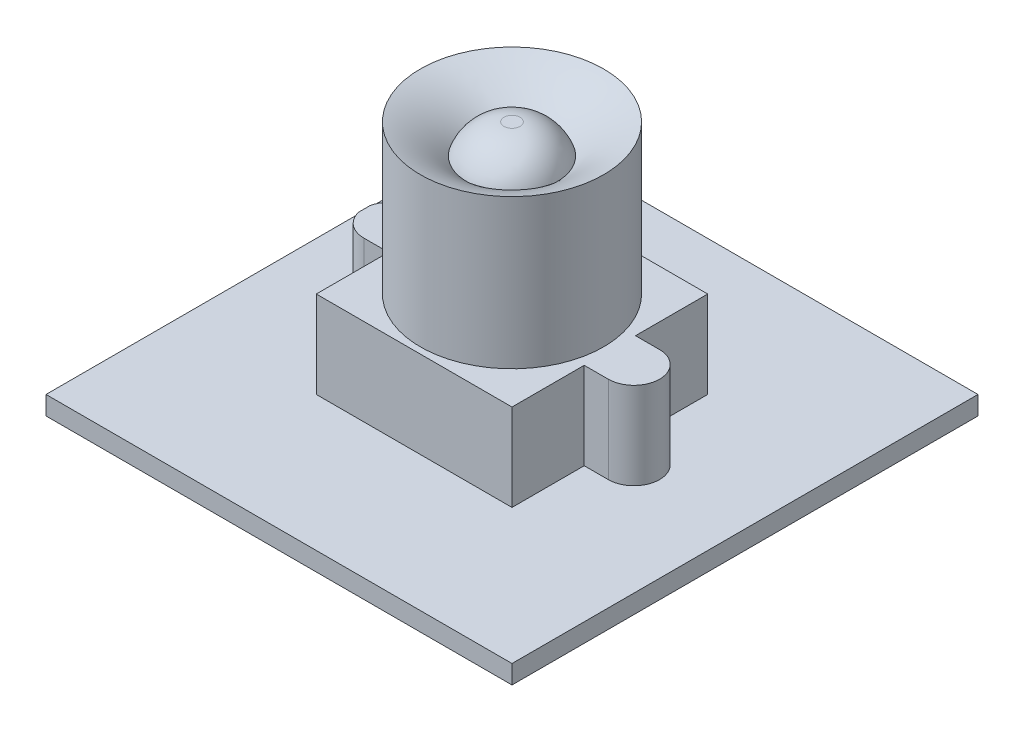
ISO-10303-21;
HEADER;
FILE_DESCRIPTION(('STEP AP214'),'2;1');
FILE_NAME('part.step','',(''),(''),'','','');
FILE_SCHEMA(('AUTOMOTIVE_DESIGN { 1 0 10303 214 1 1 1 1 }'));
ENDSEC;
DATA;
#1=APPLICATION_CONTEXT('core data for automotive mechanical design processes');
#2=APPLICATION_PROTOCOL_DEFINITION('international standard','automotive_design',2000,#1);
#3=PRODUCT_CONTEXT('',#1,'mechanical');
#4=PRODUCT('Part','Part','',(#3));
#5=PRODUCT_RELATED_PRODUCT_CATEGORY('part','',(#4));
#6=PRODUCT_DEFINITION_FORMATION('','',#4);
#7=PRODUCT_DEFINITION_CONTEXT('part definition',#1,'design');
#8=PRODUCT_DEFINITION('design','',#6,#7);
#9=PRODUCT_DEFINITION_SHAPE('','',#8);
#10=(LENGTH_UNIT() NAMED_UNIT(*) SI_UNIT(.MILLI.,.METRE.));
#11=(NAMED_UNIT(*) PLANE_ANGLE_UNIT() SI_UNIT($,.RADIAN.));
#12=(NAMED_UNIT(*) SI_UNIT($,.STERADIAN.) SOLID_ANGLE_UNIT());
#13=UNCERTAINTY_MEASURE_WITH_UNIT(LENGTH_MEASURE(1.E-05),#10,'distance_accuracy_value','');
#14=(GEOMETRIC_REPRESENTATION_CONTEXT(3) GLOBAL_UNCERTAINTY_ASSIGNED_CONTEXT((#13)) GLOBAL_UNIT_ASSIGNED_CONTEXT((#10,
#11,#12)) REPRESENTATION_CONTEXT('',''));
#15=CARTESIAN_POINT('',(0.,0.,0.));
#16=DIRECTION('',(0.,0.,1.));
#17=DIRECTION('',(1.,0.,0.));
#18=AXIS2_PLACEMENT_3D('',#15,#16,#17);
#19=CARTESIAN_POINT('',(0.,1.524,0.));
#20=DIRECTION('',(0.,1.,0.));
#21=DIRECTION('',(0.,0.,1.));
#22=AXIS2_PLACEMENT_3D('',#19,#20,#21);
#23=PLANE('',#22);
#24=DIRECTION('',(0.,0.,-1.));
#25=VECTOR('',#24,1.);
#26=CARTESIAN_POINT('',(19.05,1.524,-19.05));
#27=LINE('',#26,#25);
#28=CARTESIAN_POINT('',(19.05,1.524,19.05));
#29=VERTEX_POINT('',#28);
#30=CARTESIAN_POINT('',(19.05,1.524,-19.05));
#31=VERTEX_POINT('',#30);
#32=EDGE_CURVE('E274',#29,#31,#27,.T.);
#33=ORIENTED_EDGE('',*,*,#32,.T.);
#34=DIRECTION('',(-1.,0.,0.));
#35=VECTOR('',#34,1.);
#36=CARTESIAN_POINT('',(-19.05,1.524,-19.05));
#37=LINE('',#36,#35);
#38=CARTESIAN_POINT('',(-19.05,1.524,-19.05));
#39=VERTEX_POINT('',#38);
#40=EDGE_CURVE('E277',#31,#39,#37,.T.);
#41=ORIENTED_EDGE('',*,*,#40,.T.);
#42=DIRECTION('',(0.,0.,1.));
#43=VECTOR('',#42,1.);
#44=CARTESIAN_POINT('',(-19.05,1.524,-19.05));
#45=LINE('',#44,#43);
#46=CARTESIAN_POINT('',(-19.05,1.524,19.05));
#47=VERTEX_POINT('',#46);
#48=EDGE_CURVE('E280',#39,#47,#45,.T.);
#49=ORIENTED_EDGE('',*,*,#48,.T.);
#50=DIRECTION('',(1.,0.,0.));
#51=VECTOR('',#50,1.);
#52=CARTESIAN_POINT('',(-19.05,1.524,19.05));
#53=LINE('',#52,#51);
#54=EDGE_CURVE('E282',#47,#29,#53,.T.);
#55=ORIENTED_EDGE('',*,*,#54,.T.);
#56=EDGE_LOOP('',(#33,#41,#49,#55));
#57=FACE_BOUND('',#56,.T.);
#58=CARTESIAN_POINT('',(9.96949999999999,1.524,0.));
#59=DIRECTION('',(0.,1.,0.));
#60=DIRECTION('',(0.,0.,1.));
#61=AXIS2_PLACEMENT_3D('',#58,#59,#60);
#62=CIRCLE('',#61,2.0955);
#63=CARTESIAN_POINT('',(9.96949999999999,1.524,-2.0955));
#64=VERTEX_POINT('',#63);
#65=CARTESIAN_POINT('',(9.96949999999999,1.524,2.0955));
#66=VERTEX_POINT('',#65);
#67=EDGE_CURVE('E596',#64,#66,#62,.F.);
#68=ORIENTED_EDGE('',*,*,#67,.T.);
#69=DIRECTION('',(1.,0.,0.));
#70=VECTOR('',#69,1.);
#71=CARTESIAN_POINT('',(0.,1.524,2.0955));
#72=LINE('',#71,#70);
#73=CARTESIAN_POINT('',(8.001,1.524,2.0955));
#74=VERTEX_POINT('',#73);
#75=EDGE_CURVE('E612',#74,#66,#72,.T.);
#76=ORIENTED_EDGE('',*,*,#75,.F.);
#77=DIRECTION('',(0.,0.,-1.));
#78=VECTOR('',#77,1.);
#79=CARTESIAN_POINT('',(8.001,1.524,-8.001));
#80=LINE('',#79,#78);
#81=CARTESIAN_POINT('',(8.001,1.524,8.001));
#82=VERTEX_POINT('',#81);
#83=EDGE_CURVE('E251',#82,#74,#80,.T.);
#84=ORIENTED_EDGE('',*,*,#83,.F.);
#85=DIRECTION('',(1.,0.,0.));
#86=VECTOR('',#85,1.);
#87=CARTESIAN_POINT('',(-8.001,1.524,8.001));
#88=LINE('',#87,#86);
#89=CARTESIAN_POINT('',(-8.001,1.524,8.001));
#90=VERTEX_POINT('',#89);
#91=EDGE_CURVE('E260',#90,#82,#88,.T.);
#92=ORIENTED_EDGE('',*,*,#91,.F.);
#93=DIRECTION('',(0.,0.,1.));
#94=VECTOR('',#93,1.);
#95=CARTESIAN_POINT('',(-8.001,1.524,-8.001));
#96=LINE('',#95,#94);
#97=CARTESIAN_POINT('',(-8.001,1.524,2.0955));
#98=VERTEX_POINT('',#97);
#99=EDGE_CURVE('E256',#98,#90,#96,.T.);
#100=ORIENTED_EDGE('',*,*,#99,.F.);
#101=CARTESIAN_POINT('',(-10.0225174114188,1.524,2.0955));
#102=VERTEX_POINT('',#101);
#103=EDGE_CURVE('E585',#102,#98,#72,.T.);
#104=ORIENTED_EDGE('',*,*,#103,.F.);
#105=CARTESIAN_POINT('',(-10.0225174114188,1.524,0.));
#106=DIRECTION('',(0.,1.,0.));
#107=DIRECTION('',(0.,0.,1.));
#108=AXIS2_PLACEMENT_3D('',#105,#106,#107);
#109=CIRCLE('',#108,2.0955);
#110=CARTESIAN_POINT('',(-12.065,1.524,0.46838565877132));
#111=VERTEX_POINT('',#110);
#112=EDGE_CURVE('E613',#102,#111,#109,.F.);
#113=ORIENTED_EDGE('',*,*,#112,.T.);
#114=DIRECTION('',(0.,0.,1.));
#115=VECTOR('',#114,1.);
#116=CARTESIAN_POINT('',(-12.065,1.524,0.));
#117=LINE('',#116,#115);
#118=CARTESIAN_POINT('',(-12.065,1.524,-0.468385658771324));
#119=VERTEX_POINT('',#118);
#120=EDGE_CURVE('E219',#119,#111,#117,.T.);
#121=ORIENTED_EDGE('',*,*,#120,.F.);
#122=CARTESIAN_POINT('',(-10.0225174114188,1.524,0.));
#123=DIRECTION('',(0.,1.,0.));
#124=DIRECTION('',(0.,0.,1.));
#125=AXIS2_PLACEMENT_3D('',#122,#123,#124);
#126=CIRCLE('',#125,2.0955);
#127=CARTESIAN_POINT('',(-10.0225174114188,1.524,-2.0955));
#128=VERTEX_POINT('',#127);
#129=EDGE_CURVE('E230',#119,#128,#126,.F.);
#130=ORIENTED_EDGE('',*,*,#129,.T.);
#131=DIRECTION('',(1.,0.,0.));
#132=VECTOR('',#131,1.);
#133=CARTESIAN_POINT('',(0.,1.524,-2.0955));
#134=LINE('',#133,#132);
#135=CARTESIAN_POINT('',(-8.001,1.524,-2.0955));
#136=VERTEX_POINT('',#135);
#137=EDGE_CURVE('E196',#128,#136,#134,.T.);
#138=ORIENTED_EDGE('',*,*,#137,.T.);
#139=CARTESIAN_POINT('',(-8.001,1.524,-8.001));
#140=VERTEX_POINT('',#139);
#141=EDGE_CURVE('E257',#140,#136,#96,.T.);
#142=ORIENTED_EDGE('',*,*,#141,.F.);
#143=DIRECTION('',(-1.,0.,0.));
#144=VECTOR('',#143,1.);
#145=CARTESIAN_POINT('',(-8.001,1.524,-8.001));
#146=LINE('',#145,#144);
#147=CARTESIAN_POINT('',(8.001,1.524,-8.001));
#148=VERTEX_POINT('',#147);
#149=EDGE_CURVE('E254',#148,#140,#146,.T.);
#150=ORIENTED_EDGE('',*,*,#149,.F.);
#151=CARTESIAN_POINT('',(8.001,1.524,-2.0955));
#152=VERTEX_POINT('',#151);
#153=EDGE_CURVE('E240',#152,#148,#80,.T.);
#154=ORIENTED_EDGE('',*,*,#153,.F.);
#155=EDGE_CURVE('E599',#152,#64,#134,.T.);
#156=ORIENTED_EDGE('',*,*,#155,.T.);
#157=EDGE_LOOP('',(#68,#76,#84,#92,#100,#104,#113,#121,#130,#138,#142,#150,#154,#156));
#158=FACE_BOUND('',#157,.T.);
#159=ADVANCED_FACE('F55',(#57,#158),#23,.T.);
#160=CARTESIAN_POINT('',(8.001,8.636,-8.001));
#161=DIRECTION('',(-1.,0.,0.));
#162=DIRECTION('',(0.,0.,1.));
#163=AXIS2_PLACEMENT_3D('',#160,#161,#162);
#164=PLANE('',#163);
#165=DIRECTION('',(0.,-1.,0.));
#166=VECTOR('',#165,1.);
#167=CARTESIAN_POINT('',(8.001,8.636,2.0955));
#168=LINE('',#167,#166);
#169=CARTESIAN_POINT('',(8.001,8.636,2.0955));
#170=VERTEX_POINT('',#169);
#171=EDGE_CURVE('E235',#170,#74,#168,.T.);
#172=ORIENTED_EDGE('',*,*,#171,.F.);
#173=DIRECTION('',(0.,0.,-1.));
#174=VECTOR('',#173,1.);
#175=CARTESIAN_POINT('',(8.001,8.636,-8.001));
#176=LINE('',#175,#174);
#177=CARTESIAN_POINT('',(8.001,8.636,8.001));
#178=VERTEX_POINT('',#177);
#179=EDGE_CURVE('E241',#178,#170,#176,.T.);
#180=ORIENTED_EDGE('',*,*,#179,.F.);
#181=DIRECTION('',(0.,-1.,0.));
#182=VECTOR('',#181,1.);
#183=CARTESIAN_POINT('',(8.001,8.636,8.001));
#184=LINE('',#183,#182);
#185=EDGE_CURVE('E250',#178,#82,#184,.T.);
#186=ORIENTED_EDGE('',*,*,#185,.T.);
#187=ORIENTED_EDGE('',*,*,#83,.T.);
#188=EDGE_LOOP('',(#172,#180,#186,#187));
#189=FACE_BOUND('',#188,.T.);
#190=ADVANCED_FACE('F327',(#189),#164,.F.);
#191=CARTESIAN_POINT('',(-8.001,8.636,-8.001));
#192=DIRECTION('',(1.,0.,0.));
#193=DIRECTION('',(0.,0.,-1.));
#194=AXIS2_PLACEMENT_3D('',#191,#192,#193);
#195=PLANE('',#194);
#196=DIRECTION('',(0.,1.,0.));
#197=VECTOR('',#196,1.);
#198=CARTESIAN_POINT('',(-8.001,8.636,2.0955));
#199=LINE('',#198,#197);
#200=CARTESIAN_POINT('',(-8.001,8.636,2.0955));
#201=VERTEX_POINT('',#200);
#202=EDGE_CURVE('E233',#98,#201,#199,.T.);
#203=ORIENTED_EDGE('',*,*,#202,.F.);
#204=ORIENTED_EDGE('',*,*,#99,.T.);
#205=DIRECTION('',(0.,-1.,0.));
#206=VECTOR('',#205,1.);
#207=CARTESIAN_POINT('',(-8.001,8.636,8.001));
#208=LINE('',#207,#206);
#209=CARTESIAN_POINT('',(-8.001,8.636,8.001));
#210=VERTEX_POINT('',#209);
#211=EDGE_CURVE('E264',#210,#90,#208,.T.);
#212=ORIENTED_EDGE('',*,*,#211,.F.);
#213=DIRECTION('',(0.,0.,1.));
#214=VECTOR('',#213,1.);
#215=CARTESIAN_POINT('',(-8.001,8.636,-8.001));
#216=LINE('',#215,#214);
#217=EDGE_CURVE('E246',#201,#210,#216,.T.);
#218=ORIENTED_EDGE('',*,*,#217,.F.);
#219=EDGE_LOOP('',(#203,#204,#212,#218));
#220=FACE_BOUND('',#219,.T.);
#221=ADVANCED_FACE('F325',(#220),#195,.F.);
#222=CARTESIAN_POINT('',(19.05,1.524,-19.05));
#223=DIRECTION('',(-1.,0.,0.));
#224=DIRECTION('',(0.,0.,1.));
#225=AXIS2_PLACEMENT_3D('',#222,#223,#224);
#226=PLANE('',#225);
#227=DIRECTION('',(0.,0.,-1.));
#228=VECTOR('',#227,1.);
#229=CARTESIAN_POINT('',(19.05,0.,-19.05));
#230=LINE('',#229,#228);
#231=CARTESIAN_POINT('',(19.05,0.,19.05));
#232=VERTEX_POINT('',#231);
#233=CARTESIAN_POINT('',(19.05,0.,-19.05));
#234=VERTEX_POINT('',#233);
#235=EDGE_CURVE('E273',#232,#234,#230,.T.);
#236=ORIENTED_EDGE('',*,*,#235,.T.);
#237=DIRECTION('',(0.,-1.,0.));
#238=VECTOR('',#237,1.);
#239=CARTESIAN_POINT('',(19.05,1.524,-19.05));
#240=LINE('',#239,#238);
#241=EDGE_CURVE('E12',#31,#234,#240,.T.);
#242=ORIENTED_EDGE('',*,*,#241,.F.);
#243=ORIENTED_EDGE('',*,*,#32,.F.);
#244=DIRECTION('',(0.,-1.,0.));
#245=VECTOR('',#244,1.);
#246=CARTESIAN_POINT('',(19.05,1.524,19.05));
#247=LINE('',#246,#245);
#248=EDGE_CURVE('E284',#29,#232,#247,.T.);
#249=ORIENTED_EDGE('',*,*,#248,.T.);
#250=EDGE_LOOP('',(#236,#242,#243,#249));
#251=FACE_BOUND('',#250,.T.);
#252=ADVANCED_FACE('F57',(#251),#226,.F.);
#253=CARTESIAN_POINT('',(-19.05,1.524,-19.05));
#254=DIRECTION('',(0.,0.,1.));
#255=DIRECTION('',(1.,0.,0.));
#256=AXIS2_PLACEMENT_3D('',#253,#254,#255);
#257=PLANE('',#256);
#258=DIRECTION('',(-1.,0.,0.));
#259=VECTOR('',#258,1.);
#260=CARTESIAN_POINT('',(-19.05,0.,-19.05));
#261=LINE('',#260,#259);
#262=CARTESIAN_POINT('',(-19.05,0.,-19.05));
#263=VERTEX_POINT('',#262);
#264=EDGE_CURVE('E287',#234,#263,#261,.T.);
#265=ORIENTED_EDGE('',*,*,#264,.T.);
#266=DIRECTION('',(0.,-1.,0.));
#267=VECTOR('',#266,1.);
#268=CARTESIAN_POINT('',(-19.05,1.524,-19.05));
#269=LINE('',#268,#267);
#270=EDGE_CURVE('E64',#39,#263,#269,.T.);
#271=ORIENTED_EDGE('',*,*,#270,.F.);
#272=ORIENTED_EDGE('',*,*,#40,.F.);
#273=ORIENTED_EDGE('',*,*,#241,.T.);
#274=EDGE_LOOP('',(#265,#271,#272,#273));
#275=FACE_BOUND('',#274,.T.);
#276=ADVANCED_FACE('F318',(#275),#257,.F.);
#277=CARTESIAN_POINT('',(-19.05,1.524,-19.05));
#278=DIRECTION('',(1.,0.,0.));
#279=DIRECTION('',(0.,0.,-1.));
#280=AXIS2_PLACEMENT_3D('',#277,#278,#279);
#281=PLANE('',#280);
#282=DIRECTION('',(0.,0.,1.));
#283=VECTOR('',#282,1.);
#284=CARTESIAN_POINT('',(-19.05,0.,-19.05));
#285=LINE('',#284,#283);
#286=CARTESIAN_POINT('',(-19.05,0.,19.05));
#287=VERTEX_POINT('',#286);
#288=EDGE_CURVE('E289',#263,#287,#285,.T.);
#289=ORIENTED_EDGE('',*,*,#288,.T.);
#290=DIRECTION('',(0.,-1.,0.));
#291=VECTOR('',#290,1.);
#292=CARTESIAN_POINT('',(-19.05,1.524,19.05));
#293=LINE('',#292,#291);
#294=EDGE_CURVE('E294',#47,#287,#293,.T.);
#295=ORIENTED_EDGE('',*,*,#294,.F.);
#296=ORIENTED_EDGE('',*,*,#48,.F.);
#297=ORIENTED_EDGE('',*,*,#270,.T.);
#298=EDGE_LOOP('',(#289,#295,#296,#297));
#299=FACE_BOUND('',#298,.T.);
#300=ADVANCED_FACE('F302',(#299),#281,.F.);
#301=CARTESIAN_POINT('',(-19.05,1.524,19.05));
#302=DIRECTION('',(0.,0.,-1.));
#303=DIRECTION('',(-1.,0.,0.));
#304=AXIS2_PLACEMENT_3D('',#301,#302,#303);
#305=PLANE('',#304);
#306=DIRECTION('',(1.,0.,0.));
#307=VECTOR('',#306,1.);
#308=CARTESIAN_POINT('',(-19.05,0.,19.05));
#309=LINE('',#308,#307);
#310=EDGE_CURVE('E278',#287,#232,#309,.T.);
#311=ORIENTED_EDGE('',*,*,#310,.T.);
#312=ORIENTED_EDGE('',*,*,#248,.F.);
#313=ORIENTED_EDGE('',*,*,#54,.F.);
#314=ORIENTED_EDGE('',*,*,#294,.T.);
#315=EDGE_LOOP('',(#311,#312,#313,#314));
#316=FACE_BOUND('',#315,.T.);
#317=ADVANCED_FACE('F311',(#316),#305,.F.);
#318=CARTESIAN_POINT('',(0.,0.,0.));
#319=DIRECTION('',(0.,1.,0.));
#320=DIRECTION('',(0.,0.,1.));
#321=AXIS2_PLACEMENT_3D('',#318,#319,#320);
#322=PLANE('',#321);
#323=ORIENTED_EDGE('',*,*,#235,.F.);
#324=ORIENTED_EDGE('',*,*,#310,.F.);
#325=ORIENTED_EDGE('',*,*,#288,.F.);
#326=ORIENTED_EDGE('',*,*,#264,.F.);
#327=EDGE_LOOP('',(#323,#324,#325,#326));
#328=FACE_BOUND('',#327,.T.);
#329=ADVANCED_FACE('F308',(#328),#322,.F.);
#330=CARTESIAN_POINT('',(8.001,8.636,-2.0955));
#331=VERTEX_POINT('',#330);
#332=CARTESIAN_POINT('',(8.001,8.636,-8.001));
#333=VERTEX_POINT('',#332);
#334=EDGE_CURVE('E244',#331,#333,#176,.T.);
#335=ORIENTED_EDGE('',*,*,#334,.F.);
#336=DIRECTION('',(0.,-1.,0.));
#337=VECTOR('',#336,1.);
#338=CARTESIAN_POINT('',(8.001,8.636,-2.0955));
#339=LINE('',#338,#337);
#340=EDGE_CURVE('E229',#331,#152,#339,.T.);
#341=ORIENTED_EDGE('',*,*,#340,.T.);
#342=ORIENTED_EDGE('',*,*,#153,.T.);
#343=DIRECTION('',(0.,-1.,0.));
#344=VECTOR('',#343,1.);
#345=CARTESIAN_POINT('',(8.001,8.636,-8.001));
#346=LINE('',#345,#344);
#347=EDGE_CURVE('E270',#333,#148,#346,.T.);
#348=ORIENTED_EDGE('',*,*,#347,.F.);
#349=EDGE_LOOP('',(#335,#341,#342,#348));
#350=FACE_BOUND('',#349,.T.);
#351=ADVANCED_FACE('F334',(#350),#164,.F.);
#352=CARTESIAN_POINT('',(-8.001,8.636,-8.001));
#353=DIRECTION('',(0.,0.,1.));
#354=DIRECTION('',(1.,0.,0.));
#355=AXIS2_PLACEMENT_3D('',#352,#353,#354);
#356=PLANE('',#355);
#357=ORIENTED_EDGE('',*,*,#149,.T.);
#358=DIRECTION('',(0.,-1.,0.));
#359=VECTOR('',#358,1.);
#360=CARTESIAN_POINT('',(-8.001,8.636,-8.001));
#361=LINE('',#360,#359);
#362=CARTESIAN_POINT('',(-8.001,8.636,-8.001));
#363=VERTEX_POINT('',#362);
#364=EDGE_CURVE('E267',#363,#140,#361,.T.);
#365=ORIENTED_EDGE('',*,*,#364,.F.);
#366=DIRECTION('',(-1.,0.,0.));
#367=VECTOR('',#366,1.);
#368=CARTESIAN_POINT('',(-8.001,8.636,-8.001));
#369=LINE('',#368,#367);
#370=EDGE_CURVE('E243',#333,#363,#369,.T.);
#371=ORIENTED_EDGE('',*,*,#370,.F.);
#372=ORIENTED_EDGE('',*,*,#347,.T.);
#373=EDGE_LOOP('',(#357,#365,#371,#372));
#374=FACE_BOUND('',#373,.T.);
#375=ADVANCED_FACE('F355',(#374),#356,.F.);
#376=ORIENTED_EDGE('',*,*,#141,.T.);
#377=DIRECTION('',(0.,1.,0.));
#378=VECTOR('',#377,1.);
#379=CARTESIAN_POINT('',(-8.001,8.636,-2.0955));
#380=LINE('',#379,#378);
#381=CARTESIAN_POINT('',(-8.001,8.636,-2.0955));
#382=VERTEX_POINT('',#381);
#383=EDGE_CURVE('E227',#136,#382,#380,.T.);
#384=ORIENTED_EDGE('',*,*,#383,.T.);
#385=EDGE_CURVE('E188',#363,#382,#216,.T.);
#386=ORIENTED_EDGE('',*,*,#385,.F.);
#387=ORIENTED_EDGE('',*,*,#364,.T.);
#388=EDGE_LOOP('',(#376,#384,#386,#387));
#389=FACE_BOUND('',#388,.T.);
#390=ADVANCED_FACE('F363',(#389),#195,.F.);
#391=CARTESIAN_POINT('',(-8.001,8.636,8.001));
#392=DIRECTION('',(0.,0.,-1.));
#393=DIRECTION('',(-1.,0.,0.));
#394=AXIS2_PLACEMENT_3D('',#391,#392,#393);
#395=PLANE('',#394);
#396=ORIENTED_EDGE('',*,*,#91,.T.);
#397=ORIENTED_EDGE('',*,*,#185,.F.);
#398=DIRECTION('',(1.,0.,0.));
#399=VECTOR('',#398,1.);
#400=CARTESIAN_POINT('',(-8.001,8.636,8.001));
#401=LINE('',#400,#399);
#402=EDGE_CURVE('E248',#210,#178,#401,.T.);
#403=ORIENTED_EDGE('',*,*,#402,.F.);
#404=ORIENTED_EDGE('',*,*,#211,.T.);
#405=EDGE_LOOP('',(#396,#397,#403,#404));
#406=FACE_BOUND('',#405,.T.);
#407=ADVANCED_FACE('F370',(#406),#395,.F.);
#408=CARTESIAN_POINT('',(0.,8.636,0.));
#409=DIRECTION('',(0.,1.,0.));
#410=DIRECTION('',(0.,0.,1.));
#411=AXIS2_PLACEMENT_3D('',#408,#409,#410);
#412=PLANE('',#411);
#413=CARTESIAN_POINT('',(0.,8.636,0.));
#414=DIRECTION('',(0.,1.,0.));
#415=DIRECTION('',(0.,0.,1.));
#416=AXIS2_PLACEMENT_3D('',#413,#414,#415);
#417=CIRCLE('',#416,7.493);
#418=CARTESIAN_POINT('',(0.,8.636,-7.493));
#419=VERTEX_POINT('',#418);
#420=EDGE_CURVE('E237',#419,#419,#417,.T.);
#421=ORIENTED_EDGE('',*,*,#420,.F.);
#422=EDGE_LOOP('',(#421));
#423=FACE_BOUND('',#422,.T.);
#424=ORIENTED_EDGE('',*,*,#179,.T.);
#425=DIRECTION('',(-1.,0.,0.));
#426=VECTOR('',#425,1.);
#427=CARTESIAN_POINT('',(0.,8.636,2.0955));
#428=LINE('',#427,#426);
#429=CARTESIAN_POINT('',(9.96949999999999,8.636,2.0955));
#430=VERTEX_POINT('',#429);
#431=EDGE_CURVE('E210',#430,#170,#428,.T.);
#432=ORIENTED_EDGE('',*,*,#431,.F.);
#433=CARTESIAN_POINT('',(9.96949999999999,8.636,0.));
#434=DIRECTION('',(0.,1.,0.));
#435=DIRECTION('',(0.,0.,1.));
#436=AXIS2_PLACEMENT_3D('',#433,#434,#435);
#437=CIRCLE('',#436,2.0955);
#438=CARTESIAN_POINT('',(9.96949999999999,8.636,-2.0955));
#439=VERTEX_POINT('',#438);
#440=EDGE_CURVE('E201',#430,#439,#437,.T.);
#441=ORIENTED_EDGE('',*,*,#440,.T.);
#442=DIRECTION('',(-1.,0.,0.));
#443=VECTOR('',#442,1.);
#444=CARTESIAN_POINT('',(0.,8.636,-2.0955));
#445=LINE('',#444,#443);
#446=EDGE_CURVE('E78',#439,#331,#445,.T.);
#447=ORIENTED_EDGE('',*,*,#446,.T.);
#448=ORIENTED_EDGE('',*,*,#334,.T.);
#449=ORIENTED_EDGE('',*,*,#370,.T.);
#450=ORIENTED_EDGE('',*,*,#385,.T.);
#451=CARTESIAN_POINT('',(-10.0225174114188,8.636,-2.0955));
#452=VERTEX_POINT('',#451);
#453=EDGE_CURVE('E180',#382,#452,#445,.T.);
#454=ORIENTED_EDGE('',*,*,#453,.T.);
#455=CARTESIAN_POINT('',(-10.0225174114188,8.636,0.));
#456=DIRECTION('',(0.,1.,0.));
#457=DIRECTION('',(0.,0.,1.));
#458=AXIS2_PLACEMENT_3D('',#455,#456,#457);
#459=CIRCLE('',#458,2.0955);
#460=CARTESIAN_POINT('',(-12.065,8.636,-0.468385658771324));
#461=VERTEX_POINT('',#460);
#462=EDGE_CURVE('E186',#452,#461,#459,.T.);
#463=ORIENTED_EDGE('',*,*,#462,.T.);
#464=DIRECTION('',(0.,0.,-1.));
#465=VECTOR('',#464,1.);
#466=CARTESIAN_POINT('',(-12.065,8.636,0.));
#467=LINE('',#466,#465);
#468=CARTESIAN_POINT('',(-12.065,8.636,0.46838565877132));
#469=VERTEX_POINT('',#468);
#470=EDGE_CURVE('E205',#469,#461,#467,.T.);
#471=ORIENTED_EDGE('',*,*,#470,.F.);
#472=CARTESIAN_POINT('',(-10.0225174114188,8.636,2.0955));
#473=VERTEX_POINT('',#472);
#474=EDGE_CURVE('E207',#469,#473,#459,.T.);
#475=ORIENTED_EDGE('',*,*,#474,.T.);
#476=EDGE_CURVE('E71',#201,#473,#428,.T.);
#477=ORIENTED_EDGE('',*,*,#476,.F.);
#478=ORIENTED_EDGE('',*,*,#217,.T.);
#479=ORIENTED_EDGE('',*,*,#402,.T.);
#480=EDGE_LOOP('',(#424,#432,#441,#447,#448,#449,#450,#454,#463,#471,#475,#477,#478,#479));
#481=FACE_BOUND('',#480,.T.);
#482=ADVANCED_FACE('F183',(#423,#481),#412,.T.);
#483=CARTESIAN_POINT('',(0.,20.828,0.));
#484=DIRECTION('',(0.,-1.,0.));
#485=DIRECTION('',(0.,0.,-1.));
#486=AXIS2_PLACEMENT_3D('',#483,#484,#485);
#487=CYLINDRICAL_SURFACE('',#486,7.493);
#488=CARTESIAN_POINT('',(0.,20.828,0.));
#489=DIRECTION('',(0.,-1.,0.));
#490=DIRECTION('',(0.,0.,-1.));
#491=AXIS2_PLACEMENT_3D('',#488,#489,#490);
#492=CIRCLE('',#491,7.493);
#493=CARTESIAN_POINT('',(0.,20.828,-7.493));
#494=VERTEX_POINT('',#493);
#495=EDGE_CURVE('E619',#494,#494,#492,.T.);
#496=CARTESIAN_POINT('',(0.,20.828,-7.493));
#497=CARTESIAN_POINT('',(0.,20.701,-7.493));
#498=CARTESIAN_POINT('',(0.,20.574,-7.493));
#499=CARTESIAN_POINT('',(0.,20.32,-7.493));
#500=CARTESIAN_POINT('',(0.,20.193,-7.493));
#501=CARTESIAN_POINT('',(0.,19.939,-7.493));
#502=CARTESIAN_POINT('',(0.,19.812,-7.493));
#503=CARTESIAN_POINT('',(0.,19.558,-7.493));
#504=CARTESIAN_POINT('',(0.,19.431,-7.493));
#505=CARTESIAN_POINT('',(0.,19.177,-7.493));
#506=CARTESIAN_POINT('',(0.,19.05,-7.493));
#507=CARTESIAN_POINT('',(0.,18.796,-7.493));
#508=CARTESIAN_POINT('',(0.,18.669,-7.493));
#509=CARTESIAN_POINT('',(0.,18.415,-7.493));
#510=CARTESIAN_POINT('',(0.,18.288,-7.493));
#511=CARTESIAN_POINT('',(0.,18.034,-7.493));
#512=CARTESIAN_POINT('',(0.,17.907,-7.493));
#513=CARTESIAN_POINT('',(0.,17.653,-7.493));
#514=CARTESIAN_POINT('',(0.,17.526,-7.493));
#515=CARTESIAN_POINT('',(0.,17.272,-7.493));
#516=CARTESIAN_POINT('',(0.,17.145,-7.493));
#517=CARTESIAN_POINT('',(0.,16.891,-7.493));
#518=CARTESIAN_POINT('',(0.,16.764,-7.493));
#519=CARTESIAN_POINT('',(0.,16.51,-7.493));
#520=CARTESIAN_POINT('',(0.,16.383,-7.493));
#521=CARTESIAN_POINT('',(0.,16.129,-7.493));
#522=CARTESIAN_POINT('',(0.,16.002,-7.493));
#523=CARTESIAN_POINT('',(0.,15.748,-7.493));
#524=CARTESIAN_POINT('',(0.,15.621,-7.493));
#525=CARTESIAN_POINT('',(0.,15.367,-7.493));
#526=CARTESIAN_POINT('',(0.,15.24,-7.493));
#527=CARTESIAN_POINT('',(0.,14.986,-7.493));
#528=CARTESIAN_POINT('',(0.,14.859,-7.493));
#529=CARTESIAN_POINT('',(0.,14.605,-7.493));
#530=CARTESIAN_POINT('',(0.,14.478,-7.493));
#531=CARTESIAN_POINT('',(0.,14.224,-7.493));
#532=CARTESIAN_POINT('',(0.,14.097,-7.493));
#533=CARTESIAN_POINT('',(0.,13.843,-7.493));
#534=CARTESIAN_POINT('',(0.,13.716,-7.493));
#535=CARTESIAN_POINT('',(0.,13.462,-7.493));
#536=CARTESIAN_POINT('',(0.,13.335,-7.493));
#537=CARTESIAN_POINT('',(0.,13.081,-7.493));
#538=CARTESIAN_POINT('',(0.,12.954,-7.493));
#539=CARTESIAN_POINT('',(0.,12.7,-7.493));
#540=CARTESIAN_POINT('',(0.,12.573,-7.493));
#541=CARTESIAN_POINT('',(0.,12.319,-7.493));
#542=CARTESIAN_POINT('',(0.,12.192,-7.493));
#543=CARTESIAN_POINT('',(0.,11.938,-7.493));
#544=CARTESIAN_POINT('',(0.,11.811,-7.493));
#545=CARTESIAN_POINT('',(0.,11.557,-7.493));
#546=CARTESIAN_POINT('',(0.,11.43,-7.493));
#547=CARTESIAN_POINT('',(0.,11.176,-7.493));
#548=CARTESIAN_POINT('',(0.,11.049,-7.493));
#549=CARTESIAN_POINT('',(0.,10.795,-7.493));
#550=CARTESIAN_POINT('',(0.,10.668,-7.493));
#551=CARTESIAN_POINT('',(0.,10.414,-7.493));
#552=CARTESIAN_POINT('',(0.,10.287,-7.493));
#553=CARTESIAN_POINT('',(0.,10.033,-7.493));
#554=CARTESIAN_POINT('',(0.,9.906,-7.493));
#555=CARTESIAN_POINT('',(0.,9.652,-7.493));
#556=CARTESIAN_POINT('',(0.,9.525,-7.493));
#557=CARTESIAN_POINT('',(0.,9.271,-7.493));
#558=CARTESIAN_POINT('',(0.,9.144,-7.493));
#559=CARTESIAN_POINT('',(0.,8.89,-7.493));
#560=CARTESIAN_POINT('',(0.,8.763,-7.493));
#561=CARTESIAN_POINT('',(0.,8.636,-7.493));
#562=B_SPLINE_CURVE_WITH_KNOTS('',3,(#496,#497,#498,#499,#500,#501,#502,#503,#504,#505,#506,
#507,#508,#509,#510,#511,#512,#513,#514,#515,#516,#517,#518,#519,#520,#521,#522,#523,#524,#525,
#526,#527,#528,#529,#530,#531,#532,#533,#534,#535,#536,#537,#538,#539,#540,#541,#542,#543,#544,
#545,#546,#547,#548,#549,#550,#551,#552,#553,#554,#555,#556,#557,#558,#559,#560,#561),
.UNSPECIFIED.,.F.,.F.,(4,2,2,2,2,2,2,2,2,2,2,2,2,2,2,2,2,2,2,2,2,2,2,2,2,2,2,2,2,2,2,2,4),(0.,
0.380999999999999,0.761999999999999,1.143,1.524,1.905,2.286,2.667,3.048,3.429,3.81,4.191,4.572,
4.953,5.334,5.715,6.096,6.477,6.858,7.239,7.62,8.001,8.382,8.763,9.144,9.525,9.906,10.287,
10.668,11.049,11.43,11.811,12.192),.UNSPECIFIED.);
#563=EDGE_CURVE('BSEAM384',#494,#419,#562,.T.);
#564=ORIENTED_EDGE('',*,*,#495,.T.);
#565=ORIENTED_EDGE('',*,*,#420,.T.);
#566=ORIENTED_EDGE('',*,*,#563,.T.);
#567=ORIENTED_EDGE('',*,*,#563,.F.);
#568=EDGE_LOOP('',(#564,#566,#565,#567));
#569=FACE_BOUND('',#568,.T.);
#570=ADVANCED_FACE('F384',(#569),#487,.T.);
#571=CARTESIAN_POINT('',(0.,-22.9672511113663,-2.0955));
#572=DIRECTION('',(0.,0.,-1.));
#573=DIRECTION('',(-1.,0.,0.));
#574=AXIS2_PLACEMENT_3D('',#571,#572,#573);
#575=PLANE('',#574);
#576=ORIENTED_EDGE('',*,*,#383,.F.);
#577=ORIENTED_EDGE('',*,*,#137,.F.);
#578=DIRECTION('',(0.,1.,0.));
#579=VECTOR('',#578,1.);
#580=CARTESIAN_POINT('',(-10.0225174114188,-22.9672511113663,-2.0955));
#581=LINE('',#580,#579);
#582=EDGE_CURVE('E193',#128,#452,#581,.T.);
#583=ORIENTED_EDGE('',*,*,#582,.T.);
#584=ORIENTED_EDGE('',*,*,#453,.F.);
#585=EDGE_LOOP('',(#576,#577,#583,#584));
#586=FACE_BOUND('',#585,.T.);
#587=ADVANCED_FACE('F194',(#586),#575,.T.);
#588=CARTESIAN_POINT('',(0.,-22.9672511113663,2.0955));
#589=DIRECTION('',(0.,0.,-1.));
#590=DIRECTION('',(-1.,0.,0.));
#591=AXIS2_PLACEMENT_3D('',#588,#589,#590);
#592=PLANE('',#591);
#593=ORIENTED_EDGE('',*,*,#103,.T.);
#594=ORIENTED_EDGE('',*,*,#202,.T.);
#595=ORIENTED_EDGE('',*,*,#476,.T.);
#596=DIRECTION('',(0.,1.,0.));
#597=VECTOR('',#596,1.);
#598=CARTESIAN_POINT('',(-10.0225174114188,-22.9672511113663,2.0955));
#599=LINE('',#598,#597);
#600=EDGE_CURVE('E222',#102,#473,#599,.T.);
#601=ORIENTED_EDGE('',*,*,#600,.F.);
#602=EDGE_LOOP('',(#593,#594,#595,#601));
#603=FACE_BOUND('',#602,.T.);
#604=ADVANCED_FACE('F399',(#603),#592,.F.);
#605=CARTESIAN_POINT('',(-10.0225174114188,-22.9672511113663,0.));
#606=DIRECTION('',(0.,1.,0.));
#607=DIRECTION('',(0.,0.,1.));
#608=AXIS2_PLACEMENT_3D('',#605,#606,#607);
#609=CYLINDRICAL_SURFACE('',#608,2.0955);
#610=ORIENTED_EDGE('',*,*,#112,.F.);
#611=ORIENTED_EDGE('',*,*,#600,.T.);
#612=ORIENTED_EDGE('',*,*,#474,.F.);
#613=DIRECTION('',(0.,1.,0.));
#614=VECTOR('',#613,1.);
#615=CARTESIAN_POINT('',(-12.065,-22.9672511113663,0.46838565877132));
#616=LINE('',#615,#614);
#617=EDGE_CURVE('E224',#111,#469,#616,.T.);
#618=ORIENTED_EDGE('',*,*,#617,.F.);
#619=EDGE_LOOP('',(#610,#611,#612,#618));
#620=FACE_BOUND('',#619,.T.);
#621=ADVANCED_FACE('F407',(#620),#609,.T.);
#622=CARTESIAN_POINT('',(-12.065,-22.9672511113663,0.));
#623=DIRECTION('',(1.,0.,0.));
#624=DIRECTION('',(0.,0.,-1.));
#625=AXIS2_PLACEMENT_3D('',#622,#623,#624);
#626=PLANE('',#625);
#627=DIRECTION('',(0.,1.,0.));
#628=VECTOR('',#627,1.);
#629=CARTESIAN_POINT('',(-12.065,-22.9672511113663,-0.468385658771324));
#630=LINE('',#629,#628);
#631=EDGE_CURVE('E200',#119,#461,#630,.T.);
#632=ORIENTED_EDGE('',*,*,#631,.F.);
#633=ORIENTED_EDGE('',*,*,#120,.T.);
#634=ORIENTED_EDGE('',*,*,#617,.T.);
#635=ORIENTED_EDGE('',*,*,#470,.T.);
#636=EDGE_LOOP('',(#632,#633,#634,#635));
#637=FACE_BOUND('',#636,.T.);
#638=ADVANCED_FACE('F415',(#637),#626,.F.);
#639=ORIENTED_EDGE('',*,*,#129,.F.);
#640=ORIENTED_EDGE('',*,*,#631,.T.);
#641=ORIENTED_EDGE('',*,*,#462,.F.);
#642=ORIENTED_EDGE('',*,*,#582,.F.);
#643=EDGE_LOOP('',(#639,#640,#641,#642));
#644=FACE_BOUND('',#643,.T.);
#645=ADVANCED_FACE('F203',(#644),#609,.T.);
#646=ORIENTED_EDGE('',*,*,#431,.T.);
#647=ORIENTED_EDGE('',*,*,#171,.T.);
#648=ORIENTED_EDGE('',*,*,#75,.T.);
#649=DIRECTION('',(0.,1.,0.));
#650=VECTOR('',#649,1.);
#651=CARTESIAN_POINT('',(9.96949999999999,-22.9672511113663,2.0955));
#652=LINE('',#651,#650);
#653=EDGE_CURVE('E220',#66,#430,#652,.T.);
#654=ORIENTED_EDGE('',*,*,#653,.T.);
#655=EDGE_LOOP('',(#646,#647,#648,#654));
#656=FACE_BOUND('',#655,.T.);
#657=ADVANCED_FACE('F409',(#656),#592,.F.);
#658=ORIENTED_EDGE('',*,*,#340,.F.);
#659=ORIENTED_EDGE('',*,*,#446,.F.);
#660=DIRECTION('',(0.,1.,0.));
#661=VECTOR('',#660,1.);
#662=CARTESIAN_POINT('',(9.96949999999999,-22.9672511113663,-2.0955));
#663=LINE('',#662,#661);
#664=EDGE_CURVE('E217',#64,#439,#663,.T.);
#665=ORIENTED_EDGE('',*,*,#664,.F.);
#666=ORIENTED_EDGE('',*,*,#155,.F.);
#667=EDGE_LOOP('',(#658,#659,#665,#666));
#668=FACE_BOUND('',#667,.T.);
#669=ADVANCED_FACE('F401',(#668),#575,.T.);
#670=CARTESIAN_POINT('',(9.96949999999999,-22.9672511113663,0.));
#671=DIRECTION('',(0.,1.,0.));
#672=DIRECTION('',(0.,0.,1.));
#673=AXIS2_PLACEMENT_3D('',#670,#671,#672);
#674=CYLINDRICAL_SURFACE('',#673,2.0955);
#675=ORIENTED_EDGE('',*,*,#67,.F.);
#676=ORIENTED_EDGE('',*,*,#664,.T.);
#677=ORIENTED_EDGE('',*,*,#440,.F.);
#678=ORIENTED_EDGE('',*,*,#653,.F.);
#679=EDGE_LOOP('',(#675,#676,#677,#678));
#680=FACE_BOUND('',#679,.T.);
#681=ADVANCED_FACE('F441',(#680),#674,.T.);
#682=CARTESIAN_POINT('',(0.,17.3392171938343,0.));
#683=DIRECTION('',(0.,-1.,0.));
#684=DIRECTION('',(0.,0.,-1.));
#685=AXIS2_PLACEMENT_3D('',#682,#683,#684);
#686=DEGENERATE_TOROIDAL_SURFACE('',#685,0.355074734161719,3.50156568027885,.T.);
#687=CARTESIAN_POINT('',(0.,20.828,0.));
#688=DIRECTION('',(0.,1.,0.));
#689=DIRECTION('',(0.,0.,1.));
#690=AXIS2_PLACEMENT_3D('',#687,#688,#689);
#691=CIRCLE('',#690,0.654000719498341);
#692=CARTESIAN_POINT('',(0.,20.828,0.654000719498341));
#693=VERTEX_POINT('',#692);
#694=EDGE_CURVE('E59',#693,#693,#691,.T.);
#695=ORIENTED_EDGE('',*,*,#694,.F.);
#696=EDGE_LOOP('',(#695));
#697=FACE_BOUND('',#696,.T.);
#698=CARTESIAN_POINT('',(0.,18.4271959000511,0.));
#699=DIRECTION('',(0.,-1.,0.));
#700=DIRECTION('',(0.,0.,-1.));
#701=AXIS2_PLACEMENT_3D('',#698,#699,#700);
#702=CIRCLE('',#701,3.68332721078146);
#703=CARTESIAN_POINT('',(0.,18.4271959000511,-3.68332721078146));
#704=VERTEX_POINT('',#703);
#705=EDGE_CURVE('E616',#704,#704,#702,.T.);
#706=ORIENTED_EDGE('',*,*,#705,.F.);
#707=EDGE_LOOP('',(#706));
#708=FACE_BOUND('',#707,.T.);
#709=ADVANCED_FACE('F448',(#697,#708),#686,.T.);
#710=CARTESIAN_POINT('',(0.,11.1081857340702,0.));
#711=DIRECTION('',(0.,-1.,0.));
#712=DIRECTION('',(0.,0.,-1.));
#713=AXIS2_PLACEMENT_3D('',#710,#711,#712);
#714=TOROIDAL_SURFACE('',#713,10.9569815876342,10.3186218945963);
#715=ORIENTED_EDGE('',*,*,#705,.T.);
#716=EDGE_LOOP('',(#715));
#717=FACE_BOUND('',#716,.T.);
#718=ORIENTED_EDGE('',*,*,#495,.F.);
#719=EDGE_LOOP('',(#718));
#720=FACE_BOUND('',#719,.T.);
#721=ADVANCED_FACE('F456',(#717,#720),#714,.T.);
#722=CARTESIAN_POINT('',(0.,20.828,0.));
#723=DIRECTION('',(0.,1.,0.));
#724=DIRECTION('',(0.,0.,1.));
#725=AXIS2_PLACEMENT_3D('',#722,#723,#724);
#726=PLANE('',#725);
#727=ORIENTED_EDGE('',*,*,#694,.T.);
#728=EDGE_LOOP('',(#727));
#729=FACE_BOUND('',#728,.T.);
#730=ADVANCED_FACE('F464',(#729),#726,.T.);
#731=CLOSED_SHELL('',(#159,#190,#221,#252,#276,#300,#317,#329,#351,#375,#390,#407,#482,#570,
#587,#604,#621,#638,#645,#657,#669,#681,#709,#721,#730));
#732=MANIFOLD_SOLID_BREP('B2',#731);
#733=ADVANCED_BREP_SHAPE_REPRESENTATION('',(#18,#732),#14);
#734=SHAPE_DEFINITION_REPRESENTATION(#9,#733);
ENDSEC;
END-ISO-10303-21;
